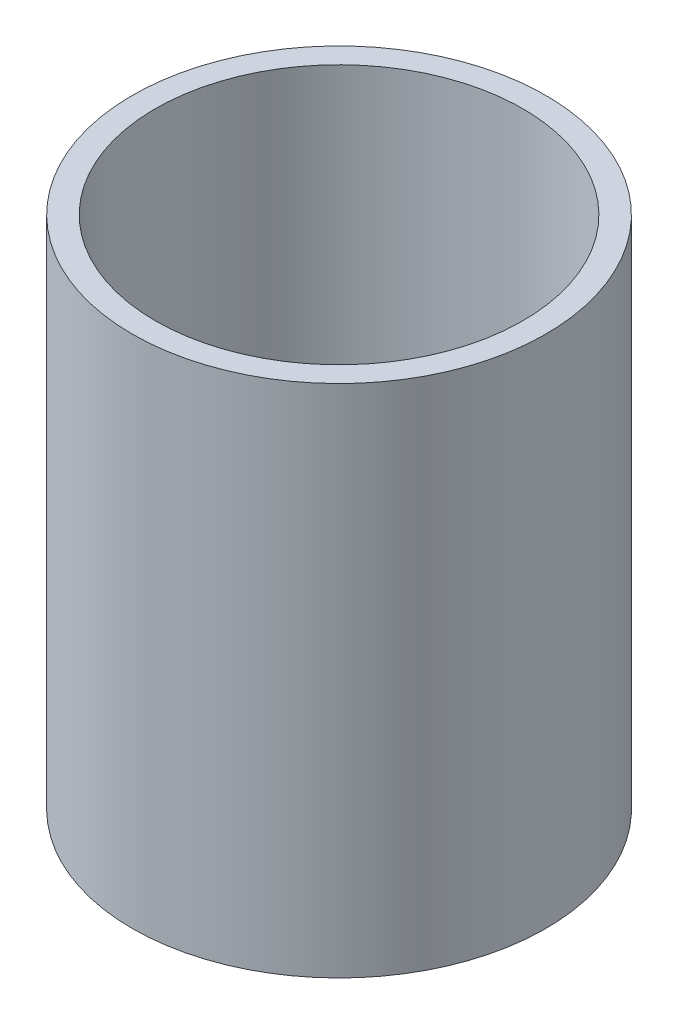
ISO-10303-21;
HEADER;
FILE_DESCRIPTION(('STEP AP214'),'2;1');
FILE_NAME('part.step','',(''),(''),'','','');
FILE_SCHEMA(('AUTOMOTIVE_DESIGN { 1 0 10303 214 1 1 1 1 }'));
ENDSEC;
DATA;
#1=APPLICATION_CONTEXT('core data for automotive mechanical design processes');
#2=APPLICATION_PROTOCOL_DEFINITION('international standard','automotive_design',2000,#1);
#3=PRODUCT_CONTEXT('',#1,'mechanical');
#4=PRODUCT('Part','Part','',(#3));
#5=PRODUCT_RELATED_PRODUCT_CATEGORY('part','',(#4));
#6=PRODUCT_DEFINITION_FORMATION('','',#4);
#7=PRODUCT_DEFINITION_CONTEXT('part definition',#1,'design');
#8=PRODUCT_DEFINITION('design','',#6,#7);
#9=PRODUCT_DEFINITION_SHAPE('','',#8);
#10=(LENGTH_UNIT() NAMED_UNIT(*) SI_UNIT(.MILLI.,.METRE.));
#11=(NAMED_UNIT(*) PLANE_ANGLE_UNIT() SI_UNIT($,.RADIAN.));
#12=(NAMED_UNIT(*) SI_UNIT($,.STERADIAN.) SOLID_ANGLE_UNIT());
#13=UNCERTAINTY_MEASURE_WITH_UNIT(LENGTH_MEASURE(1.E-05),#10,'distance_accuracy_value','');
#14=(GEOMETRIC_REPRESENTATION_CONTEXT(3) GLOBAL_UNCERTAINTY_ASSIGNED_CONTEXT((#13)) GLOBAL_UNIT_ASSIGNED_CONTEXT((#10,
#11,#12)) REPRESENTATION_CONTEXT('',''));
#15=CARTESIAN_POINT('',(0.,0.,0.));
#16=DIRECTION('',(0.,0.,1.));
#17=DIRECTION('',(1.,0.,0.));
#18=AXIS2_PLACEMENT_3D('',#15,#16,#17);
#19=CARTESIAN_POINT('',(0.,80.9206705103537,0.));
#20=DIRECTION('',(0.,-1.,0.));
#21=DIRECTION('',(0.,0.,-1.));
#22=AXIS2_PLACEMENT_3D('',#19,#20,#21);
#23=CYLINDRICAL_SURFACE('',#22,32.5);
#24=CARTESIAN_POINT('',(0.,80.9206705103537,0.));
#25=DIRECTION('',(0.,1.,0.));
#26=DIRECTION('',(0.,0.,1.));
#27=AXIS2_PLACEMENT_3D('',#24,#25,#26);
#28=CIRCLE('',#27,32.5);
#29=CARTESIAN_POINT('',(0.,80.9206705103537,32.5));
#30=VERTEX_POINT('',#29);
#31=EDGE_CURVE('E10',#30,#30,#28,.T.);
#32=ORIENTED_EDGE('',*,*,#31,.F.);
#33=EDGE_LOOP('',(#32));
#34=FACE_BOUND('',#33,.T.);
#35=CARTESIAN_POINT('',(0.,0.,0.));
#36=DIRECTION('',(0.,1.,0.));
#37=DIRECTION('',(0.,0.,1.));
#38=AXIS2_PLACEMENT_3D('',#35,#36,#37);
#39=CIRCLE('',#38,32.5);
#40=CARTESIAN_POINT('',(0.,0.,32.5));
#41=VERTEX_POINT('',#40);
#42=EDGE_CURVE('E37',#41,#41,#39,.T.);
#43=ORIENTED_EDGE('',*,*,#42,.T.);
#44=EDGE_LOOP('',(#43));
#45=FACE_BOUND('',#44,.T.);
#46=ADVANCED_FACE('F40',(#34,#45),#23,.T.);
#47=CARTESIAN_POINT('',(0.,80.9206705103537,0.));
#48=DIRECTION('',(0.,1.,0.));
#49=DIRECTION('',(0.,0.,1.));
#50=AXIS2_PLACEMENT_3D('',#47,#48,#49);
#51=PLANE('',#50);
#52=CARTESIAN_POINT('',(0.,80.9206705103537,0.));
#53=DIRECTION('',(0.,1.,0.));
#54=DIRECTION('',(0.,0.,1.));
#55=AXIS2_PLACEMENT_3D('',#52,#53,#54);
#56=CIRCLE('',#55,28.8838629102913);
#57=CARTESIAN_POINT('',(0.,80.9206705103537,28.8838629102913));
#58=VERTEX_POINT('',#57);
#59=EDGE_CURVE('E50',#58,#58,#56,.T.);
#60=ORIENTED_EDGE('',*,*,#59,.F.);
#61=EDGE_LOOP('',(#60));
#62=FACE_BOUND('',#61,.T.);
#63=ORIENTED_EDGE('',*,*,#31,.T.);
#64=EDGE_LOOP('',(#63));
#65=FACE_BOUND('',#64,.T.);
#66=ADVANCED_FACE('F59',(#62,#65),#51,.T.);
#67=CARTESIAN_POINT('',(0.,0.,0.));
#68=DIRECTION('',(0.,1.,0.));
#69=DIRECTION('',(0.,0.,1.));
#70=AXIS2_PLACEMENT_3D('',#67,#68,#69);
#71=PLANE('',#70);
#72=CARTESIAN_POINT('',(0.,0.,0.));
#73=DIRECTION('',(0.,1.,0.));
#74=DIRECTION('',(0.,0.,1.));
#75=AXIS2_PLACEMENT_3D('',#72,#73,#74);
#76=CIRCLE('',#75,28.8838629102913);
#77=CARTESIAN_POINT('',(0.,0.,28.8838629102913));
#78=VERTEX_POINT('',#77);
#79=EDGE_CURVE('E47',#78,#78,#76,.T.);
#80=ORIENTED_EDGE('',*,*,#79,.T.);
#81=EDGE_LOOP('',(#80));
#82=FACE_BOUND('',#81,.T.);
#83=ORIENTED_EDGE('',*,*,#42,.F.);
#84=EDGE_LOOP('',(#83));
#85=FACE_BOUND('',#84,.T.);
#86=ADVANCED_FACE('F58',(#82,#85),#71,.F.);
#87=CARTESIAN_POINT('',(0.,80.9206705103537,0.));
#88=DIRECTION('',(0.,-1.,0.));
#89=DIRECTION('',(0.,0.,-1.));
#90=AXIS2_PLACEMENT_3D('',#87,#88,#89);
#91=CYLINDRICAL_SURFACE('',#90,28.8838629102913);
#92=ORIENTED_EDGE('',*,*,#59,.T.);
#93=EDGE_LOOP('',(#92));
#94=FACE_BOUND('',#93,.T.);
#95=ORIENTED_EDGE('',*,*,#79,.F.);
#96=EDGE_LOOP('',(#95));
#97=FACE_BOUND('',#96,.T.);
#98=ADVANCED_FACE('F54',(#94,#97),#91,.F.);
#99=CLOSED_SHELL('',(#46,#66,#86,#98));
#100=MANIFOLD_SOLID_BREP('B2',#99);
#101=ADVANCED_BREP_SHAPE_REPRESENTATION('',(#18,#100),#14);
#102=SHAPE_DEFINITION_REPRESENTATION(#9,#101);
ENDSEC;
END-ISO-10303-21;
